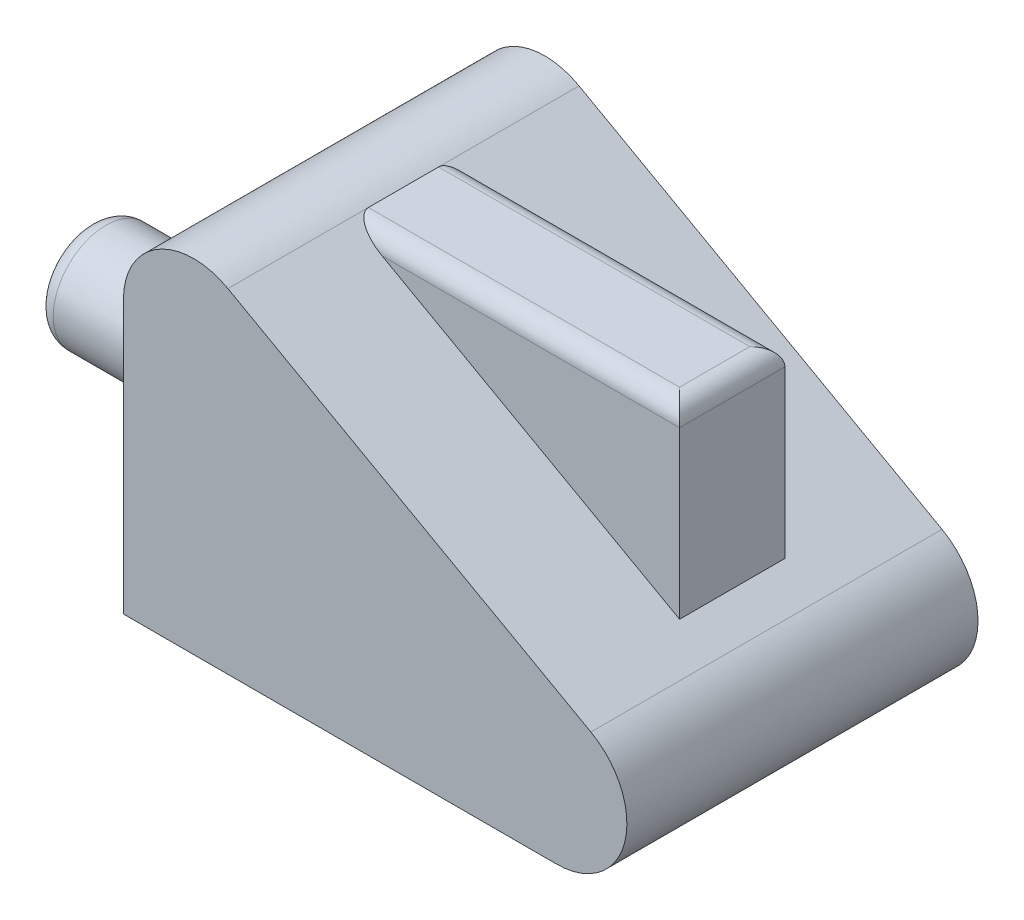
ISO-10303-21;
HEADER;
FILE_DESCRIPTION(('STEP AP214'),'2;1');
FILE_NAME('part.step','',(''),(''),'','','');
FILE_SCHEMA(('AUTOMOTIVE_DESIGN { 1 0 10303 214 1 1 1 1 }'));
ENDSEC;
DATA;
#1=APPLICATION_CONTEXT('core data for automotive mechanical design processes');
#2=APPLICATION_PROTOCOL_DEFINITION('international standard','automotive_design',2000,#1);
#3=PRODUCT_CONTEXT('',#1,'mechanical');
#4=PRODUCT('Part','Part','',(#3));
#5=PRODUCT_RELATED_PRODUCT_CATEGORY('part','',(#4));
#6=PRODUCT_DEFINITION_FORMATION('','',#4);
#7=PRODUCT_DEFINITION_CONTEXT('part definition',#1,'design');
#8=PRODUCT_DEFINITION('design','',#6,#7);
#9=PRODUCT_DEFINITION_SHAPE('','',#8);
#10=(LENGTH_UNIT() NAMED_UNIT(*) SI_UNIT(.MILLI.,.METRE.));
#11=(NAMED_UNIT(*) PLANE_ANGLE_UNIT() SI_UNIT($,.RADIAN.));
#12=(NAMED_UNIT(*) SI_UNIT($,.STERADIAN.) SOLID_ANGLE_UNIT());
#13=UNCERTAINTY_MEASURE_WITH_UNIT(LENGTH_MEASURE(1.E-05),#10,'distance_accuracy_value','');
#14=(GEOMETRIC_REPRESENTATION_CONTEXT(3) GLOBAL_UNCERTAINTY_ASSIGNED_CONTEXT((#13)) GLOBAL_UNIT_ASSIGNED_CONTEXT((#10,
#11,#12)) REPRESENTATION_CONTEXT('',''));
#15=CARTESIAN_POINT('',(0.,0.,0.));
#16=DIRECTION('',(0.,0.,1.));
#17=DIRECTION('',(1.,0.,0.));
#18=AXIS2_PLACEMENT_3D('',#15,#16,#17);
#19=CARTESIAN_POINT('',(0.,0.,5.));
#20=DIRECTION('',(1.,0.,0.));
#21=DIRECTION('',(0.,0.,-1.));
#22=AXIS2_PLACEMENT_3D('',#19,#20,#21);
#23=PLANE('',#22);
#24=CARTESIAN_POINT('',(0.,1.42000000000001,2.5));
#25=DIRECTION('',(1.,0.,0.));
#26=DIRECTION('',(0.,0.,-1.));
#27=AXIS2_PLACEMENT_3D('',#24,#25,#26);
#28=CIRCLE('',#27,0.75);
#29=CARTESIAN_POINT('',(0.,1.42000000000001,1.75));
#30=VERTEX_POINT('',#29);
#31=EDGE_CURVE('E170',#30,#30,#28,.F.);
#32=ORIENTED_EDGE('',*,*,#31,.F.);
#33=EDGE_LOOP('',(#32));
#34=FACE_BOUND('',#33,.T.);
#35=DIRECTION('',(0.,0.,-1.));
#36=VECTOR('',#35,1.);
#37=CARTESIAN_POINT('',(0.,0.,5.));
#38=LINE('',#37,#36);
#39=CARTESIAN_POINT('',(0.,0.,5.));
#40=VERTEX_POINT('',#39);
#41=CARTESIAN_POINT('',(0.,0.,0.));
#42=VERTEX_POINT('',#41);
#43=EDGE_CURVE('E140',#40,#42,#38,.T.);
#44=ORIENTED_EDGE('',*,*,#43,.F.);
#45=DIRECTION('',(0.,-1.,0.));
#46=VECTOR('',#45,1.);
#47=CARTESIAN_POINT('',(0.,0.,5.));
#48=LINE('',#47,#46);
#49=CARTESIAN_POINT('',(0.,3.88414675280996,5.));
#50=VERTEX_POINT('',#49);
#51=EDGE_CURVE('E157',#50,#40,#48,.T.);
#52=ORIENTED_EDGE('',*,*,#51,.F.);
#53=DIRECTION('',(0.,0.,-1.));
#54=VECTOR('',#53,1.);
#55=CARTESIAN_POINT('',(0.,3.88414675280996,5.));
#56=LINE('',#55,#54);
#57=CARTESIAN_POINT('',(0.,3.88414675280996,0.));
#58=VERTEX_POINT('',#57);
#59=EDGE_CURVE('E150',#50,#58,#56,.T.);
#60=ORIENTED_EDGE('',*,*,#59,.T.);
#61=DIRECTION('',(0.,-1.,0.));
#62=VECTOR('',#61,1.);
#63=CARTESIAN_POINT('',(0.,0.,0.));
#64=LINE('',#63,#62);
#65=EDGE_CURVE('E167',#58,#42,#64,.T.);
#66=ORIENTED_EDGE('',*,*,#65,.T.);
#67=EDGE_LOOP('',(#44,#52,#60,#66));
#68=FACE_BOUND('',#67,.T.);
#69=ADVANCED_FACE('F37',(#34,#68),#23,.F.);
#70=CARTESIAN_POINT('',(0.,0.,5.));
#71=DIRECTION('',(0.,1.,0.));
#72=DIRECTION('',(0.,0.,1.));
#73=AXIS2_PLACEMENT_3D('',#70,#71,#72);
#74=PLANE('',#73);
#75=DIRECTION('',(1.,0.,0.));
#76=VECTOR('',#75,1.);
#77=CARTESIAN_POINT('',(0.,0.,0.));
#78=LINE('',#77,#76);
#79=CARTESIAN_POINT('',(6.16889759108033,0.,0.));
#80=VERTEX_POINT('',#79);
#81=EDGE_CURVE('E164',#42,#80,#78,.T.);
#82=ORIENTED_EDGE('',*,*,#81,.T.);
#83=DIRECTION('',(0.,0.,-1.));
#84=VECTOR('',#83,1.);
#85=CARTESIAN_POINT('',(6.16889759108033,0.,5.));
#86=LINE('',#85,#84);
#87=CARTESIAN_POINT('',(6.16889759108033,0.,5.));
#88=VERTEX_POINT('',#87);
#89=EDGE_CURVE('E143',#88,#80,#86,.T.);
#90=ORIENTED_EDGE('',*,*,#89,.F.);
#91=DIRECTION('',(1.,0.,0.));
#92=VECTOR('',#91,1.);
#93=CARTESIAN_POINT('',(0.,0.,5.));
#94=LINE('',#93,#92);
#95=EDGE_CURVE('E178',#40,#88,#94,.T.);
#96=ORIENTED_EDGE('',*,*,#95,.F.);
#97=ORIENTED_EDGE('',*,*,#43,.T.);
#98=EDGE_LOOP('',(#82,#90,#96,#97));
#99=FACE_BOUND('',#98,.T.);
#100=ADVANCED_FACE('F220',(#99),#74,.F.);
#101=CARTESIAN_POINT('',(6.16889759108039,1.,5.));
#102=DIRECTION('',(0.,0.,-1.));
#103=DIRECTION('',(-1.,0.,0.));
#104=AXIS2_PLACEMENT_3D('',#101,#102,#103);
#105=CYLINDRICAL_SURFACE('',#104,1.);
#106=CARTESIAN_POINT('',(6.16889759108039,1.,0.));
#107=DIRECTION('',(0.,0.,1.));
#108=DIRECTION('',(1.,0.,0.));
#109=AXIS2_PLACEMENT_3D('',#106,#107,#108);
#110=CIRCLE('',#109,1.);
#111=CARTESIAN_POINT('',(6.6561582022661,1.87325660420459,0.));
#112=VERTEX_POINT('',#111);
#113=EDGE_CURVE('E161',#80,#112,#110,.T.);
#114=ORIENTED_EDGE('',*,*,#113,.T.);
#115=DIRECTION('',(0.,0.,-1.));
#116=VECTOR('',#115,1.);
#117=CARTESIAN_POINT('',(6.6561582022661,1.87325660420459,5.));
#118=LINE('',#117,#116);
#119=CARTESIAN_POINT('',(6.6561582022661,1.87325660420459,5.));
#120=VERTEX_POINT('',#119);
#121=EDGE_CURVE('E146',#120,#112,#118,.T.);
#122=ORIENTED_EDGE('',*,*,#121,.F.);
#123=CARTESIAN_POINT('',(6.16889759108039,1.,5.));
#124=DIRECTION('',(0.,0.,1.));
#125=DIRECTION('',(1.,0.,0.));
#126=AXIS2_PLACEMENT_3D('',#123,#124,#125);
#127=CIRCLE('',#126,1.);
#128=EDGE_CURVE('E175',#88,#120,#127,.T.);
#129=ORIENTED_EDGE('',*,*,#128,.F.);
#130=ORIENTED_EDGE('',*,*,#89,.T.);
#131=EDGE_LOOP('',(#114,#122,#129,#130));
#132=FACE_BOUND('',#131,.T.);
#133=ADVANCED_FACE('F226',(#132),#105,.T.);
#134=CARTESIAN_POINT('',(2.37740173357122,4.26072150514328,5.));
#135=DIRECTION('',(0.487260611185762,0.873256604204559,0.));
#136=DIRECTION('',(-0.873256604204559,0.487260611185762,0.));
#137=AXIS2_PLACEMENT_3D('',#134,#135,#136);
#138=PLANE('',#137);
#139=DIRECTION('',(-0.873256604204559,0.487260611185762,0.));
#140=VECTOR('',#139,1.);
#141=CARTESIAN_POINT('',(2.37740173357122,4.26072150514328,1.75));
#142=LINE('',#141,#140);
#143=CARTESIAN_POINT('',(6.16889759108033,2.14513877729092,1.75));
#144=VERTEX_POINT('',#143);
#145=CARTESIAN_POINT('',(1.93530452452378,4.50740335701452,1.75));
#146=VERTEX_POINT('',#145);
#147=EDGE_CURVE('E185',#144,#146,#142,.T.);
#148=ORIENTED_EDGE('',*,*,#147,.F.);
#149=DIRECTION('',(0.,0.,-1.));
#150=VECTOR('',#149,1.);
#151=CARTESIAN_POINT('',(6.16889759108033,2.14513877729092,5.));
#152=LINE('',#151,#150);
#153=CARTESIAN_POINT('',(6.16889759108033,2.14513877729092,3.25));
#154=VERTEX_POINT('',#153);
#155=EDGE_CURVE('E137',#154,#144,#152,.T.);
#156=ORIENTED_EDGE('',*,*,#155,.F.);
#157=DIRECTION('',(0.873256604204559,-0.487260611185762,0.));
#158=VECTOR('',#157,1.);
#159=CARTESIAN_POINT('',(2.37740173357122,4.26072150514328,3.25));
#160=LINE('',#159,#158);
#161=CARTESIAN_POINT('',(1.93530452452378,4.50740335701452,3.25));
#162=VERTEX_POINT('',#161);
#163=EDGE_CURVE('E187',#162,#154,#160,.T.);
#164=ORIENTED_EDGE('',*,*,#163,.F.);
#165=CARTESIAN_POINT('',(1.93530452452379,4.50740335701452,3.));
#166=DIRECTION('',(0.487260611185762,0.873256604204559,0.));
#167=DIRECTION('',(0.873256604204559,-0.487260611185762,0.));
#168=AXIS2_PLACEMENT_3D('',#165,#166,#167);
#169=ELLIPSE('',#168,0.513072459092514,0.25);
#170=CARTESIAN_POINT('',(1.48726061118577,4.75740335701452,3.));
#171=VERTEX_POINT('',#170);
#172=EDGE_CURVE('E11',#162,#171,#169,.F.);
#173=ORIENTED_EDGE('',*,*,#172,.T.);
#174=DIRECTION('',(0.,0.,-1.));
#175=VECTOR('',#174,1.);
#176=CARTESIAN_POINT('',(1.48726061118577,4.75740335701452,5.));
#177=LINE('',#176,#175);
#178=CARTESIAN_POINT('',(1.48726061118577,4.75740335701452,5.));
#179=VERTEX_POINT('',#178);
#180=EDGE_CURVE('E54',#179,#171,#177,.T.);
#181=ORIENTED_EDGE('',*,*,#180,.F.);
#182=DIRECTION('',(0.873256604204559,-0.487260611185762,0.));
#183=VECTOR('',#182,1.);
#184=CARTESIAN_POINT('',(2.37740173357122,4.26072150514328,5.));
#185=LINE('',#184,#183);
#186=EDGE_CURVE('E172',#179,#120,#185,.T.);
#187=ORIENTED_EDGE('',*,*,#186,.T.);
#188=ORIENTED_EDGE('',*,*,#121,.T.);
#189=DIRECTION('',(0.873256604204559,-0.487260611185762,0.));
#190=VECTOR('',#189,1.);
#191=CARTESIAN_POINT('',(2.37740173357122,4.26072150514328,0.));
#192=LINE('',#191,#190);
#193=CARTESIAN_POINT('',(1.48726061118577,4.75740335701452,0.));
#194=VERTEX_POINT('',#193);
#195=EDGE_CURVE('E158',#194,#112,#192,.T.);
#196=ORIENTED_EDGE('',*,*,#195,.F.);
#197=CARTESIAN_POINT('',(1.48726061118577,4.75740335701452,2.));
#198=VERTEX_POINT('',#197);
#199=EDGE_CURVE('E76',#198,#194,#177,.T.);
#200=ORIENTED_EDGE('',*,*,#199,.F.);
#201=CARTESIAN_POINT('',(1.93530452452379,4.50740335701452,2.));
#202=DIRECTION('',(0.487260611185762,0.873256604204559,0.));
#203=DIRECTION('',(-0.873256604204559,0.487260611185762,0.));
#204=AXIS2_PLACEMENT_3D('',#201,#202,#203);
#205=ELLIPSE('',#204,0.513072459092514,0.25);
#206=EDGE_CURVE('E46',#198,#146,#205,.F.);
#207=ORIENTED_EDGE('',*,*,#206,.T.);
#208=EDGE_LOOP('',(#148,#156,#164,#173,#181,#187,#188,#196,#200,#207));
#209=FACE_BOUND('',#208,.T.);
#210=ADVANCED_FACE('F200',(#209),#138,.T.);
#211=CARTESIAN_POINT('',(1.,3.88414675280997,5.));
#212=DIRECTION('',(0.,0.,-1.));
#213=DIRECTION('',(-1.,0.,0.));
#214=AXIS2_PLACEMENT_3D('',#211,#212,#213);
#215=CYLINDRICAL_SURFACE('',#214,1.);
#216=CARTESIAN_POINT('',(1.,3.88414675280997,0.));
#217=DIRECTION('',(0.,0.,1.));
#218=DIRECTION('',(1.,0.,0.));
#219=AXIS2_PLACEMENT_3D('',#216,#217,#218);
#220=CIRCLE('',#219,1.);
#221=EDGE_CURVE('E154',#58,#194,#220,.F.);
#222=ORIENTED_EDGE('',*,*,#221,.F.);
#223=ORIENTED_EDGE('',*,*,#59,.F.);
#224=CARTESIAN_POINT('',(1.,3.88414675280997,5.));
#225=DIRECTION('',(0.,0.,1.));
#226=DIRECTION('',(1.,0.,0.));
#227=AXIS2_PLACEMENT_3D('',#224,#225,#226);
#228=CIRCLE('',#227,1.);
#229=EDGE_CURVE('E153',#50,#179,#228,.F.);
#230=ORIENTED_EDGE('',*,*,#229,.T.);
#231=ORIENTED_EDGE('',*,*,#180,.T.);
#232=DIRECTION('',(0.,0.,-1.));
#233=VECTOR('',#232,1.);
#234=CARTESIAN_POINT('',(1.48726061118577,4.75740335701452,3.25));
#235=LINE('',#234,#233);
#236=EDGE_CURVE('E119',#171,#198,#235,.T.);
#237=ORIENTED_EDGE('',*,*,#236,.T.);
#238=ORIENTED_EDGE('',*,*,#199,.T.);
#239=EDGE_LOOP('',(#222,#223,#230,#231,#237,#238));
#240=FACE_BOUND('',#239,.T.);
#241=ADVANCED_FACE('F255',(#240),#215,.T.);
#242=CARTESIAN_POINT('',(0.,0.,5.));
#243=DIRECTION('',(0.,0.,1.));
#244=DIRECTION('',(1.,0.,0.));
#245=AXIS2_PLACEMENT_3D('',#242,#243,#244);
#246=PLANE('',#245);
#247=ORIENTED_EDGE('',*,*,#51,.T.);
#248=ORIENTED_EDGE('',*,*,#95,.T.);
#249=ORIENTED_EDGE('',*,*,#128,.T.);
#250=ORIENTED_EDGE('',*,*,#186,.F.);
#251=ORIENTED_EDGE('',*,*,#229,.F.);
#252=EDGE_LOOP('',(#247,#248,#249,#250,#251));
#253=FACE_BOUND('',#252,.T.);
#254=ADVANCED_FACE('F250',(#253),#246,.T.);
#255=CARTESIAN_POINT('',(0.,0.,0.));
#256=DIRECTION('',(0.,0.,1.));
#257=DIRECTION('',(1.,0.,0.));
#258=AXIS2_PLACEMENT_3D('',#255,#256,#257);
#259=PLANE('',#258);
#260=ORIENTED_EDGE('',*,*,#65,.F.);
#261=ORIENTED_EDGE('',*,*,#221,.T.);
#262=ORIENTED_EDGE('',*,*,#195,.T.);
#263=ORIENTED_EDGE('',*,*,#113,.F.);
#264=ORIENTED_EDGE('',*,*,#81,.F.);
#265=EDGE_LOOP('',(#260,#261,#262,#263,#264));
#266=FACE_BOUND('',#265,.T.);
#267=ADVANCED_FACE('F277',(#266),#259,.F.);
#268=CARTESIAN_POINT('',(7.40608809980573,1.42000000000001,2.5));
#269=DIRECTION('',(-1.,0.,0.));
#270=DIRECTION('',(0.,-1.,0.));
#271=AXIS2_PLACEMENT_3D('',#268,#269,#270);
#272=CYLINDRICAL_SURFACE('',#271,0.75);
#273=CARTESIAN_POINT('',(-2.75,1.42,2.5));
#274=DIRECTION('',(1.,0.,0.));
#275=DIRECTION('',(0.,1.,0.));
#276=AXIS2_PLACEMENT_3D('',#273,#274,#275);
#277=CIRCLE('',#276,0.75);
#278=CARTESIAN_POINT('',(-2.75,2.17,2.5));
#279=VERTEX_POINT('',#278);
#280=EDGE_CURVE('E131',#279,#279,#277,.T.);
#281=ORIENTED_EDGE('',*,*,#280,.T.);
#282=EDGE_LOOP('',(#281));
#283=FACE_BOUND('',#282,.T.);
#284=ORIENTED_EDGE('',*,*,#31,.T.);
#285=EDGE_LOOP('',(#284));
#286=FACE_BOUND('',#285,.T.);
#287=ADVANCED_FACE('F214',(#283,#286),#272,.T.);
#288=CARTESIAN_POINT('',(-3.,0.,5.));
#289=DIRECTION('',(1.,0.,0.));
#290=DIRECTION('',(0.,1.,0.));
#291=AXIS2_PLACEMENT_3D('',#288,#289,#290);
#292=PLANE('',#291);
#293=CARTESIAN_POINT('',(-3.,1.42,2.5));
#294=DIRECTION('',(1.,0.,0.));
#295=DIRECTION('',(0.,1.,0.));
#296=AXIS2_PLACEMENT_3D('',#293,#294,#295);
#297=CIRCLE('',#296,0.5);
#298=CARTESIAN_POINT('',(-3.,1.92,2.5));
#299=VERTEX_POINT('',#298);
#300=EDGE_CURVE('E134',#299,#299,#297,.F.);
#301=ORIENTED_EDGE('',*,*,#300,.T.);
#302=EDGE_LOOP('',(#301));
#303=FACE_BOUND('',#302,.T.);
#304=ADVANCED_FACE('F207',(#303),#292,.F.);
#305=CARTESIAN_POINT('',(6.16889759108033,4.75740335701452,1.75));
#306=DIRECTION('',(0.,0.,-1.));
#307=DIRECTION('',(-1.,0.,0.));
#308=AXIS2_PLACEMENT_3D('',#305,#306,#307);
#309=PLANE('',#308);
#310=ORIENTED_EDGE('',*,*,#147,.T.);
#311=DIRECTION('',(1.,0.,0.));
#312=VECTOR('',#311,1.);
#313=CARTESIAN_POINT('',(6.16889759108033,4.50740335701452,1.75));
#314=LINE('',#313,#312);
#315=CARTESIAN_POINT('',(6.16889759108033,4.50740335701452,1.75));
#316=VERTEX_POINT('',#315);
#317=EDGE_CURVE('E89',#146,#316,#314,.T.);
#318=ORIENTED_EDGE('',*,*,#317,.T.);
#319=DIRECTION('',(0.,-1.,0.));
#320=VECTOR('',#319,1.);
#321=CARTESIAN_POINT('',(6.16889759108033,4.75740335701452,1.75));
#322=LINE('',#321,#320);
#323=EDGE_CURVE('E122',#316,#144,#322,.T.);
#324=ORIENTED_EDGE('',*,*,#323,.T.);
#325=EDGE_LOOP('',(#310,#318,#324));
#326=FACE_BOUND('',#325,.T.);
#327=ADVANCED_FACE('F204',(#326),#309,.T.);
#328=CARTESIAN_POINT('',(1.48726061118577,4.75740335701452,3.25));
#329=DIRECTION('',(0.,0.,1.));
#330=DIRECTION('',(1.,0.,0.));
#331=AXIS2_PLACEMENT_3D('',#328,#329,#330);
#332=PLANE('',#331);
#333=DIRECTION('',(0.,-1.,0.));
#334=VECTOR('',#333,1.);
#335=CARTESIAN_POINT('',(6.16889759108033,4.75740335701452,3.25));
#336=LINE('',#335,#334);
#337=CARTESIAN_POINT('',(6.16889759108033,4.50740335701452,3.25));
#338=VERTEX_POINT('',#337);
#339=EDGE_CURVE('E189',#338,#154,#336,.T.);
#340=ORIENTED_EDGE('',*,*,#339,.F.);
#341=DIRECTION('',(-1.,0.,0.));
#342=VECTOR('',#341,1.);
#343=CARTESIAN_POINT('',(1.48726061118577,4.50740335701452,3.25));
#344=LINE('',#343,#342);
#345=EDGE_CURVE('E63',#338,#162,#344,.T.);
#346=ORIENTED_EDGE('',*,*,#345,.T.);
#347=ORIENTED_EDGE('',*,*,#163,.T.);
#348=EDGE_LOOP('',(#340,#346,#347));
#349=FACE_BOUND('',#348,.T.);
#350=ADVANCED_FACE('F206',(#349),#332,.T.);
#351=CARTESIAN_POINT('',(6.16889759108033,4.75740335701452,3.25));
#352=DIRECTION('',(1.,0.,0.));
#353=DIRECTION('',(0.,0.,-1.));
#354=AXIS2_PLACEMENT_3D('',#351,#352,#353);
#355=PLANE('',#354);
#356=ORIENTED_EDGE('',*,*,#323,.F.);
#357=DIRECTION('',(0.,0.,1.));
#358=VECTOR('',#357,1.);
#359=CARTESIAN_POINT('',(6.16889759108033,4.50740335701452,3.25));
#360=LINE('',#359,#358);
#361=EDGE_CURVE('E117',#316,#338,#360,.T.);
#362=ORIENTED_EDGE('',*,*,#361,.T.);
#363=ORIENTED_EDGE('',*,*,#339,.T.);
#364=ORIENTED_EDGE('',*,*,#155,.T.);
#365=EDGE_LOOP('',(#356,#362,#363,#364));
#366=FACE_BOUND('',#365,.T.);
#367=ADVANCED_FACE('F196',(#366),#355,.T.);
#368=CARTESIAN_POINT('',(0.,4.75740335701452,0.));
#369=DIRECTION('',(0.,-1.,0.));
#370=DIRECTION('',(0.,0.,-1.));
#371=AXIS2_PLACEMENT_3D('',#368,#369,#370);
#372=PLANE('',#371);
#373=DIRECTION('',(0.,0.,1.));
#374=VECTOR('',#373,1.);
#375=CARTESIAN_POINT('',(5.91889759108033,4.75740335701452,1.75));
#376=LINE('',#375,#374);
#377=CARTESIAN_POINT('',(5.91889759108033,4.75740335701452,3.));
#378=VERTEX_POINT('',#377);
#379=CARTESIAN_POINT('',(5.91889759108033,4.75740335701452,2.));
#380=VERTEX_POINT('',#379);
#381=EDGE_CURVE('E98',#378,#380,#376,.F.);
#382=ORIENTED_EDGE('',*,*,#381,.T.);
#383=DIRECTION('',(1.,0.,0.));
#384=VECTOR('',#383,1.);
#385=CARTESIAN_POINT('',(1.48726061118577,4.75740335701452,2.));
#386=LINE('',#385,#384);
#387=EDGE_CURVE('E101',#380,#198,#386,.F.);
#388=ORIENTED_EDGE('',*,*,#387,.T.);
#389=ORIENTED_EDGE('',*,*,#236,.F.);
#390=DIRECTION('',(-1.,0.,0.));
#391=VECTOR('',#390,1.);
#392=CARTESIAN_POINT('',(6.16889759108033,4.75740335701452,3.));
#393=LINE('',#392,#391);
#394=EDGE_CURVE('E103',#171,#378,#393,.F.);
#395=ORIENTED_EDGE('',*,*,#394,.T.);
#396=EDGE_LOOP('',(#382,#388,#389,#395));
#397=FACE_BOUND('',#396,.T.);
#398=ADVANCED_FACE('F100',(#397),#372,.F.);
#399=CARTESIAN_POINT('',(-2.75,1.42,2.5));
#400=DIRECTION('',(1.,0.,0.));
#401=DIRECTION('',(0.,1.,0.));
#402=AXIS2_PLACEMENT_3D('',#399,#400,#401);
#403=TOROIDAL_SURFACE('',#402,0.5,0.25);
#404=ORIENTED_EDGE('',*,*,#280,.F.);
#405=EDGE_LOOP('',(#404));
#406=FACE_BOUND('',#405,.T.);
#407=ORIENTED_EDGE('',*,*,#300,.F.);
#408=EDGE_LOOP('',(#407));
#409=FACE_BOUND('',#408,.T.);
#410=ADVANCED_FACE('F233',(#406,#409),#403,.T.);
#411=CARTESIAN_POINT('',(6.16889759108033,4.50740335701452,2.));
#412=DIRECTION('',(-1.,0.,0.));
#413=DIRECTION('',(0.,0.,1.));
#414=AXIS2_PLACEMENT_3D('',#411,#412,#413);
#415=CYLINDRICAL_SURFACE('',#414,0.25);
#416=ORIENTED_EDGE('',*,*,#206,.F.);
#417=ORIENTED_EDGE('',*,*,#387,.F.);
#418=CARTESIAN_POINT('',(5.91889759108033,4.50740335701452,2.));
#419=DIRECTION('',(-0.707106781186547,0.,-0.707106781186547));
#420=DIRECTION('',(-0.707106781186547,0.,0.707106781186547));
#421=AXIS2_PLACEMENT_3D('',#418,#419,#420);
#422=ELLIPSE('',#421,0.353553390593274,0.25);
#423=EDGE_CURVE('E41',#316,#380,#422,.F.);
#424=ORIENTED_EDGE('',*,*,#423,.F.);
#425=ORIENTED_EDGE('',*,*,#317,.F.);
#426=EDGE_LOOP('',(#416,#417,#424,#425));
#427=FACE_BOUND('',#426,.T.);
#428=ADVANCED_FACE('F39',(#427),#415,.T.);
#429=CARTESIAN_POINT('',(1.48726061118577,4.50740335701452,3.));
#430=DIRECTION('',(1.,0.,0.));
#431=DIRECTION('',(0.,0.,-1.));
#432=AXIS2_PLACEMENT_3D('',#429,#430,#431);
#433=CYLINDRICAL_SURFACE('',#432,0.25);
#434=ORIENTED_EDGE('',*,*,#172,.F.);
#435=ORIENTED_EDGE('',*,*,#345,.F.);
#436=CARTESIAN_POINT('',(5.91889759108033,4.50740335701452,3.));
#437=DIRECTION('',(0.707106781186547,0.,-0.707106781186547));
#438=DIRECTION('',(0.707106781186547,0.,0.707106781186547));
#439=AXIS2_PLACEMENT_3D('',#436,#437,#438);
#440=ELLIPSE('',#439,0.353553390593274,0.25);
#441=EDGE_CURVE('E120',#378,#338,#440,.T.);
#442=ORIENTED_EDGE('',*,*,#441,.F.);
#443=ORIENTED_EDGE('',*,*,#394,.F.);
#444=EDGE_LOOP('',(#434,#435,#442,#443));
#445=FACE_BOUND('',#444,.T.);
#446=ADVANCED_FACE('F238',(#445),#433,.T.);
#447=CARTESIAN_POINT('',(5.91889759108033,4.50740335701452,3.25));
#448=DIRECTION('',(0.,0.,-1.));
#449=DIRECTION('',(-1.,0.,0.));
#450=AXIS2_PLACEMENT_3D('',#447,#448,#449);
#451=CYLINDRICAL_SURFACE('',#450,0.25);
#452=ORIENTED_EDGE('',*,*,#423,.T.);
#453=ORIENTED_EDGE('',*,*,#381,.F.);
#454=ORIENTED_EDGE('',*,*,#441,.T.);
#455=ORIENTED_EDGE('',*,*,#361,.F.);
#456=EDGE_LOOP('',(#452,#453,#454,#455));
#457=FACE_BOUND('',#456,.T.);
#458=ADVANCED_FACE('F115',(#457),#451,.T.);
#459=CLOSED_SHELL('',(#69,#100,#133,#210,#241,#254,#267,#287,#304,#327,#350,#367,#398,#410,#428,
#446,#458));
#460=MANIFOLD_SOLID_BREP('B2',#459);
#461=ADVANCED_BREP_SHAPE_REPRESENTATION('',(#18,#460),#14);
#462=SHAPE_DEFINITION_REPRESENTATION(#9,#461);
ENDSEC;
END-ISO-10303-21;
